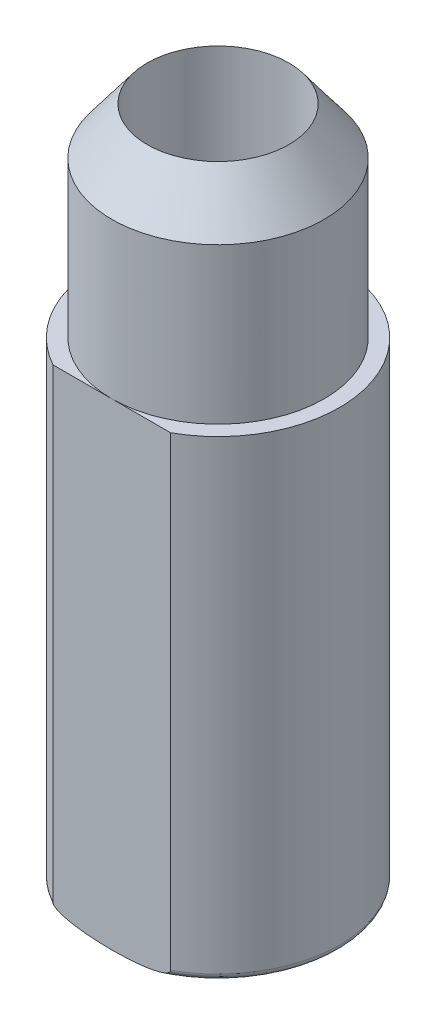
ISO-10303-21;
HEADER;
FILE_DESCRIPTION(('STEP AP214'),'2;1');
FILE_NAME('part.step','',(''),(''),'','','');
FILE_SCHEMA(('AUTOMOTIVE_DESIGN { 1 0 10303 214 1 1 1 1 }'));
ENDSEC;
DATA;
#1=APPLICATION_CONTEXT('core data for automotive mechanical design processes');
#2=APPLICATION_PROTOCOL_DEFINITION('international standard','automotive_design',2000,#1);
#3=PRODUCT_CONTEXT('',#1,'mechanical');
#4=PRODUCT('Part','Part','',(#3));
#5=PRODUCT_RELATED_PRODUCT_CATEGORY('part','',(#4));
#6=PRODUCT_DEFINITION_FORMATION('','',#4);
#7=PRODUCT_DEFINITION_CONTEXT('part definition',#1,'design');
#8=PRODUCT_DEFINITION('design','',#6,#7);
#9=PRODUCT_DEFINITION_SHAPE('','',#8);
#10=(LENGTH_UNIT() NAMED_UNIT(*) SI_UNIT(.MILLI.,.METRE.));
#11=(NAMED_UNIT(*) PLANE_ANGLE_UNIT() SI_UNIT($,.RADIAN.));
#12=(NAMED_UNIT(*) SI_UNIT($,.STERADIAN.) SOLID_ANGLE_UNIT());
#13=UNCERTAINTY_MEASURE_WITH_UNIT(LENGTH_MEASURE(1.E-05),#10,'distance_accuracy_value','');
#14=(GEOMETRIC_REPRESENTATION_CONTEXT(3) GLOBAL_UNCERTAINTY_ASSIGNED_CONTEXT((#13)) GLOBAL_UNIT_ASSIGNED_CONTEXT((#10,
#11,#12)) REPRESENTATION_CONTEXT('',''));
#15=CARTESIAN_POINT('',(0.,0.,0.));
#16=DIRECTION('',(0.,0.,1.));
#17=DIRECTION('',(1.,0.,0.));
#18=AXIS2_PLACEMENT_3D('',#15,#16,#17);
#19=CARTESIAN_POINT('',(0.,76.2,0.));
#20=DIRECTION('',(0.,-1.,0.));
#21=DIRECTION('',(0.,0.,-1.));
#22=AXIS2_PLACEMENT_3D('',#19,#20,#21);
#23=CYLINDRICAL_SURFACE('',#22,19.05);
#24=CARTESIAN_POINT('',(0.,3.175,0.));
#25=DIRECTION('',(0.,-1.,0.));
#26=DIRECTION('',(0.,0.,-1.));
#27=AXIS2_PLACEMENT_3D('',#24,#25,#26);
#28=CIRCLE('',#27,19.05);
#29=CARTESIAN_POINT('',(-9.22254159315643,3.175,16.66875));
#30=VERTEX_POINT('',#29);
#31=CARTESIAN_POINT('',(9.22254159315642,3.17500000000003,16.66875));
#32=VERTEX_POINT('',#31);
#33=EDGE_CURVE('E59',#30,#32,#28,.T.);
#34=ORIENTED_EDGE('',*,*,#33,.F.);
#35=DIRECTION('',(0.,-1.,0.));
#36=VECTOR('',#35,1.);
#37=CARTESIAN_POINT('',(-9.22254159315642,76.2,16.66875));
#38=LINE('',#37,#36);
#39=CARTESIAN_POINT('',(-9.22254159315641,76.2,16.66875));
#40=VERTEX_POINT('',#39);
#41=EDGE_CURVE('E66',#30,#40,#38,.F.);
#42=ORIENTED_EDGE('',*,*,#41,.T.);
#43=CARTESIAN_POINT('',(0.,76.2,0.));
#44=DIRECTION('',(0.,1.,0.));
#45=DIRECTION('',(0.,0.,1.));
#46=AXIS2_PLACEMENT_3D('',#43,#44,#45);
#47=CIRCLE('',#46,19.05);
#48=CARTESIAN_POINT('',(9.22254159315641,76.2,16.66875));
#49=VERTEX_POINT('',#48);
#50=EDGE_CURVE('E91',#49,#40,#47,.T.);
#51=ORIENTED_EDGE('',*,*,#50,.F.);
#52=DIRECTION('',(0.,-1.,0.));
#53=VECTOR('',#52,1.);
#54=CARTESIAN_POINT('',(9.22254159315642,76.2,16.66875));
#55=LINE('',#54,#53);
#56=EDGE_CURVE('E54',#49,#32,#55,.T.);
#57=ORIENTED_EDGE('',*,*,#56,.T.);
#58=EDGE_LOOP('',(#34,#42,#51,#57));
#59=FACE_BOUND('',#58,.T.);
#60=ADVANCED_FACE('F40',(#59),#23,.T.);
#61=CARTESIAN_POINT('',(0.,76.2,0.));
#62=DIRECTION('',(0.,-1.,0.));
#63=DIRECTION('',(0.,0.,-1.));
#64=AXIS2_PLACEMENT_3D('',#61,#62,#63);
#65=CYLINDRICAL_SURFACE('',#64,11.1125);
#66=CARTESIAN_POINT('',(0.,107.95,0.));
#67=DIRECTION('',(0.,-1.,0.));
#68=DIRECTION('',(0.,0.,-1.));
#69=AXIS2_PLACEMENT_3D('',#66,#67,#68);
#70=CIRCLE('',#69,11.1125);
#71=CARTESIAN_POINT('',(0.,107.95,-11.1125));
#72=VERTEX_POINT('',#71);
#73=EDGE_CURVE('E95',#72,#72,#70,.T.);
#74=ORIENTED_EDGE('',*,*,#73,.F.);
#75=EDGE_LOOP('',(#74));
#76=FACE_BOUND('',#75,.T.);
#77=CARTESIAN_POINT('',(0.,0.231696225433908,0.));
#78=DIRECTION('',(0.,-1.,0.));
#79=DIRECTION('',(0.,0.,-1.));
#80=AXIS2_PLACEMENT_3D('',#77,#78,#79);
#81=CIRCLE('',#80,11.1125);
#82=CARTESIAN_POINT('',(0.,0.231696225433908,-11.1125));
#83=VERTEX_POINT('',#82);
#84=EDGE_CURVE('E79',#83,#83,#81,.T.);
#85=ORIENTED_EDGE('',*,*,#84,.T.);
#86=EDGE_LOOP('',(#85));
#87=FACE_BOUND('',#86,.T.);
#88=ADVANCED_FACE('F119',(#76,#87),#65,.F.);
#89=CARTESIAN_POINT('',(24.2711047016303,0.,16.66875));
#90=DIRECTION('',(0.,0.,-1.));
#91=DIRECTION('',(-1.,0.,0.));
#92=AXIS2_PLACEMENT_3D('',#89,#90,#91);
#93=PLANE('',#92);
#94=CARTESIAN_POINT('',(9.22254159315641,3.175,16.66875));
#95=CARTESIAN_POINT('',(9.22254606778377,3.1629881546595,16.66875));
#96=CARTESIAN_POINT('',(9.22197797228461,3.15098338715665,16.66875));
#97=CARTESIAN_POINT('',(9.21973942484359,3.12709306561417,16.66875));
#98=CARTESIAN_POINT('',(9.21807047519535,3.11520737148848,16.66875));
#99=CARTESIAN_POINT('',(9.21153464750275,3.0801623785676,16.66875));
#100=CARTESIAN_POINT('',(9.2051361985547,3.0572792106606,16.66875));
#101=CARTESIAN_POINT('',(9.18647176949325,3.0061747306503,16.66875));
#102=CARTESIAN_POINT('',(9.17302515770907,2.97839604343599,16.66875));
#103=CARTESIAN_POINT('',(9.14189481847611,2.9251910866358,16.66875));
#104=CARTESIAN_POINT('',(9.1241859720157,2.89978005053384,16.66875));
#105=CARTESIAN_POINT('',(9.08792028837702,2.85390658989999,16.66875));
#106=CARTESIAN_POINT('',(9.06965820119863,2.83320573026087,16.66875));
#107=CARTESIAN_POINT('',(9.03142675859457,2.79342979725043,16.66875));
#108=CARTESIAN_POINT('',(9.01145593188844,2.7743561537631,16.66875));
#109=CARTESIAN_POINT('',(8.97022847075626,2.73760447559731,16.66875));
#110=CARTESIAN_POINT('',(8.94896999008213,2.71992853281137,16.66875));
#111=CARTESIAN_POINT('',(8.90550381857863,2.6858128314063,16.66875));
#112=CARTESIAN_POINT('',(8.88329648616773,2.66937261236882,16.66875));
#113=CARTESIAN_POINT('',(8.82479887374419,2.62814796686749,16.66875));
#114=CARTESIAN_POINT('',(8.78793962330154,2.60417204786244,16.66875));
#115=CARTESIAN_POINT('',(8.71290051102256,2.55837079888831,16.66875));
#116=CARTESIAN_POINT('',(8.67471991659821,2.53654668860634,16.66875));
#117=CARTESIAN_POINT('',(8.55861874648863,2.4736408524192,16.66875));
#118=CARTESIAN_POINT('',(8.47926479795816,2.43520950713879,16.66875));
#119=CARTESIAN_POINT('',(8.31793083478968,2.36319293073343,16.66875));
#120=CARTESIAN_POINT('',(8.23593877782103,2.32963551405348,16.66875));
#121=CARTESIAN_POINT('',(8.07058619801096,2.2664385688428,16.66875));
#122=CARTESIAN_POINT('',(7.98722748718518,2.23679426046164,16.66875));
#123=CARTESIAN_POINT('',(7.78219657233457,2.16805866969926,16.66875));
#124=CARTESIAN_POINT('',(7.65997135467144,2.1306287846481,16.66875));
#125=CARTESIAN_POINT('',(7.41413367160966,2.06059018805917,16.66875));
#126=CARTESIAN_POINT('',(7.29052082117956,2.02798285210247,16.66875));
#127=CARTESIAN_POINT('',(7.04208913157886,1.96656641431697,16.66875));
#128=CARTESIAN_POINT('',(6.91726831918551,1.937765351413,16.66875));
#129=CARTESIAN_POINT('',(6.66692579773154,1.88337285213374,16.66875));
#130=CARTESIAN_POINT('',(6.54140403407761,1.85778166950575,16.66875));
#131=CARTESIAN_POINT('',(6.16382174664767,1.78503042718831,16.66875));
#132=CARTESIAN_POINT('',(5.91097423054029,1.74194736510495,16.66875));
#133=CARTESIAN_POINT('',(5.4040500921396,1.66411888734336,16.66875));
#134=CARTESIAN_POINT('',(5.14997354228582,1.62937298623497,16.66875));
#135=CARTESIAN_POINT('',(4.64133702267686,1.56675752661278,16.66875));
#136=CARTESIAN_POINT('',(4.38677820260846,1.5388785523361,16.66875));
#137=CARTESIAN_POINT('',(3.87718180834107,1.48895052687898,16.66875));
#138=CARTESIAN_POINT('',(3.62214441763624,1.46689957480072,16.6687499999999));
#139=CARTESIAN_POINT('',(3.02357033550386,1.42121074715611,16.6687499999998));
#140=CARTESIAN_POINT('',(2.67987475124389,1.39965272953413,16.6687499999999));
#141=CARTESIAN_POINT('',(1.99196797357422,1.36477058047847,16.66875));
#142=CARTESIAN_POINT('',(1.64775665214386,1.35144903678658,16.66875));
#143=CARTESIAN_POINT('',(0.959733168110416,1.33248411640517,16.66875));
#144=CARTESIAN_POINT('',(0.615921377634202,1.32682718868932,16.66875));
#145=CARTESIAN_POINT('',(-0.0717448674756204,1.32291717100372,16.66875));
#146=CARTESIAN_POINT('',(-0.415599322753855,1.32466421140059,16.66875));
#147=CARTESIAN_POINT('',(-1.22809700860532,1.33759894352558,16.66875));
#148=CARTESIAN_POINT('',(-1.69669734710899,1.35198546979525,16.66875));
#149=CARTESIAN_POINT('',(-2.39913170048791,1.38483199565114,16.66875));
#150=CARTESIAN_POINT('',(-2.63323956924977,1.39766184681142,16.66875));
#151=CARTESIAN_POINT('',(-3.1011960673583,1.42737655651722,16.66875));
#152=CARTESIAN_POINT('',(-3.33504470196266,1.44426133125248,16.66875));
#153=CARTESIAN_POINT('',(-3.88749216309281,1.48943049656623,16.66875));
#154=CARTESIAN_POINT('',(-4.20593759152963,1.51962698881809,16.66875));
#155=CARTESIAN_POINT('',(-4.84172642256794,1.5897692612377,16.66875));
#156=CARTESIAN_POINT('',(-5.15907000596443,1.62971335706962,16.6687499999998));
#157=CARTESIAN_POINT('',(-5.69213521131905,1.70736832897352,16.6687499999999));
#158=CARTESIAN_POINT('',(-5.90833202923688,1.74180818939681,16.66875));
#159=CARTESIAN_POINT('',(-6.33951105882302,1.81778149665756,16.66875));
#160=CARTESIAN_POINT('',(-6.55449323743743,1.85931513558616,16.66875));
#161=CARTESIAN_POINT('',(-6.9157343839279,1.93720999030806,16.66875));
#162=CARTESIAN_POINT('',(-7.06251487779857,1.97114420608181,16.66875));
#163=CARTESIAN_POINT('',(-7.35468643347198,2.04447772524628,16.66875));
#164=CARTESIAN_POINT('',(-7.50007788190048,2.08387545757643,16.66875));
#165=CARTESIAN_POINT('',(-7.74444495049113,2.15670268803965,16.66875));
#166=CARTESIAN_POINT('',(-7.8439762224163,2.18825506125298,16.66875));
#167=CARTESIAN_POINT('',(-8.04159305216791,2.25578946347049,16.66875));
#168=CARTESIAN_POINT('',(-8.13967789751803,2.29177359888232,16.66875));
#169=CARTESIAN_POINT('',(-8.32823541525081,2.36745914813959,16.66875));
#170=CARTESIAN_POINT('',(-8.41883023131569,2.40684769716333,16.6687499999999));
#171=CARTESIAN_POINT('',(-8.55206327217623,2.47141235655806,16.66875));
#172=CARTESIAN_POINT('',(-8.59602727302763,2.49384529618027,16.6687500000001));
#173=CARTESIAN_POINT('',(-8.68272869927184,2.5409549514331,16.6687499999999));
#174=CARTESIAN_POINT('',(-8.72546657701292,2.56563082521089,16.6687499999995));
#175=CARTESIAN_POINT('',(-8.81399606930384,2.62075225944511,16.6687499999994));
#176=CARTESIAN_POINT('',(-8.85958027149799,2.65153487902817,16.6687499999999));
#177=CARTESIAN_POINT('',(-8.94738225939212,2.71767619293549,16.6687500000001));
#178=CARTESIAN_POINT('',(-8.98960265320783,2.75303128509789,16.66875));
#179=CARTESIAN_POINT('',(-9.05419775782409,2.81624819659929,16.6687499999999));
#180=CARTESIAN_POINT('',(-9.07830145027011,2.84232248703585,16.66875));
#181=CARTESIAN_POINT('',(-9.12277686704237,2.89752263231704,16.66875));
#182=CARTESIAN_POINT('',(-9.14315459503167,2.92664345705885,16.66875));
#183=CARTESIAN_POINT('',(-9.17301918528461,2.97899370386308,16.66875));
#184=CARTESIAN_POINT('',(-9.18394209718991,3.00139450820551,16.66875));
#185=CARTESIAN_POINT('',(-9.20209719642695,3.0476178177468,16.66875));
#186=CARTESIAN_POINT('',(-9.20934135904295,3.07143542430876,16.66875));
#187=CARTESIAN_POINT('',(-9.21704525679595,3.10871854805596,16.66875));
#188=CARTESIAN_POINT('',(-9.21909329172745,3.12186590616567,16.66875));
#189=CARTESIAN_POINT('',(-9.22184690919064,3.14833840575267,16.66875));
#190=CARTESIAN_POINT('',(-9.2225485576283,3.1616639540094,16.66875));
#191=CARTESIAN_POINT('',(-9.22254159315641,3.175,16.66875));
#192=B_SPLINE_CURVE_WITH_KNOTS('',3,(#94,#95,#96,#97,#98,#99,#100,#101,#102,#103,#104,#105,#106,
#107,#108,#109,#110,#111,#112,#113,#114,#115,#116,#117,#118,#119,#120,#121,#122,#123,#124,#125,
#126,#127,#128,#129,#130,#131,#132,#133,#134,#135,#136,#137,#138,#139,#140,#141,#142,#143,#144,
#145,#146,#147,#148,#149,#150,#151,#152,#153,#154,#155,#156,#157,#158,#159,#160,#161,#162,#163,
#164,#165,#166,#167,#168,#169,#170,#171,#172,#173,#174,#175,#176,#177,#178,#179,#180,#181,#182,
#183,#184,#185,#186,#187,#188,#189,#190,#191),.UNSPECIFIED.,.F.,.F.,(4,2,2,2,2,2,2,2,2,2,2,2,2,
2,2,2,2,2,2,2,2,2,2,2,2,2,2,2,2,2,2,2,2,2,2,2,2,2,2,2,2,2,2,2,2,2,2,2,4),(0.,0.0360092951232805,
0.0719695511225502,0.142897335979975,0.234972491496345,0.327604173848465,0.41029899762355,
0.493065755020224,0.575954130022981,0.658811466958355,0.790620132487981,0.922503085339752,
1.18672118529809,1.45239239799874,1.71773603038405,2.10107899336235,2.48453109084612,
2.86878052748982,3.25306032068498,4.022328489893,4.79155185768361,5.55971453898097,
6.3276263623073,7.36062165382101,8.39394132789881,9.42543170038312,10.4569402350837,
11.8631494090528,12.5664993008945,13.26983465661,14.2293358556368,15.1886713750367,
15.8453552815703,16.502056973149,16.9539391225309,17.4056915994253,17.7188509135646,
18.0321596503175,18.3282542697732,18.4762750879469,18.6242405762729,18.7890767151517,
18.9537837793903,19.0600945904138,19.1662325630435,19.2407579980297,19.3150392527431,
19.3548939173985,19.3948648597054),.UNSPECIFIED.);
#193=EDGE_CURVE('E11',#32,#30,#192,.T.);
#194=ORIENTED_EDGE('',*,*,#193,.F.);
#195=ORIENTED_EDGE('',*,*,#56,.F.);
#196=DIRECTION('',(-1.,0.,0.));
#197=VECTOR('',#196,1.);
#198=CARTESIAN_POINT('',(24.2711047016303,76.2,16.66875));
#199=LINE('',#198,#197);
#200=CARTESIAN_POINT('',(0.,76.2,16.66875));
#201=VERTEX_POINT('',#200);
#202=EDGE_CURVE('E104',#49,#201,#199,.T.);
#203=ORIENTED_EDGE('',*,*,#202,.T.);
#204=EDGE_CURVE('E83',#201,#40,#199,.T.);
#205=ORIENTED_EDGE('',*,*,#204,.T.);
#206=ORIENTED_EDGE('',*,*,#41,.F.);
#207=EDGE_LOOP('',(#194,#195,#203,#205,#206));
#208=FACE_BOUND('',#207,.T.);
#209=ADVANCED_FACE('F81',(#208),#93,.F.);
#210=CARTESIAN_POINT('',(0.,76.2,0.));
#211=DIRECTION('',(0.,1.,0.));
#212=DIRECTION('',(0.,0.,1.));
#213=AXIS2_PLACEMENT_3D('',#210,#211,#212);
#214=PLANE('',#213);
#215=ORIENTED_EDGE('',*,*,#202,.F.);
#216=ORIENTED_EDGE('',*,*,#50,.T.);
#217=ORIENTED_EDGE('',*,*,#204,.F.);
#218=CARTESIAN_POINT('',(0.,76.2,0.));
#219=DIRECTION('',(0.,1.,0.));
#220=DIRECTION('',(0.,0.,1.));
#221=AXIS2_PLACEMENT_3D('',#218,#219,#220);
#222=CIRCLE('',#221,16.66875);
#223=EDGE_CURVE('E86',#201,#201,#222,.T.);
#224=ORIENTED_EDGE('',*,*,#223,.F.);
#225=EDGE_LOOP('',(#215,#216,#217,#224));
#226=FACE_BOUND('',#225,.T.);
#227=ADVANCED_FACE('F118',(#226),#214,.T.);
#228=CARTESIAN_POINT('',(0.,107.95,0.));
#229=DIRECTION('',(0.,-1.,0.));
#230=DIRECTION('',(0.,0.,-1.));
#231=AXIS2_PLACEMENT_3D('',#228,#229,#230);
#232=CYLINDRICAL_SURFACE('',#231,16.66875);
#233=CARTESIAN_POINT('',(0.,100.576607209871,0.));
#234=DIRECTION('',(0.,-1.,0.));
#235=DIRECTION('',(0.,0.,-1.));
#236=AXIS2_PLACEMENT_3D('',#233,#234,#235);
#237=CIRCLE('',#236,16.66875);
#238=CARTESIAN_POINT('',(0.,100.576607209871,-16.66875));
#239=VERTEX_POINT('',#238);
#240=EDGE_CURVE('E100',#239,#239,#237,.T.);
#241=ORIENTED_EDGE('',*,*,#240,.T.);
#242=EDGE_LOOP('',(#241));
#243=FACE_BOUND('',#242,.T.);
#244=ORIENTED_EDGE('',*,*,#223,.T.);
#245=EDGE_LOOP('',(#244));
#246=FACE_BOUND('',#245,.T.);
#247=ADVANCED_FACE('F122',(#243,#246),#232,.T.);
#248=CARTESIAN_POINT('',(0.,107.95,0.));
#249=DIRECTION('',(0.,-1.,0.));
#250=DIRECTION('',(0.,0.,-1.));
#251=AXIS2_PLACEMENT_3D('',#248,#249,#250);
#252=CONICAL_SURFACE('',#251,11.1125,0.645771823237897);
#253=ORIENTED_EDGE('',*,*,#240,.F.);
#254=EDGE_LOOP('',(#253));
#255=FACE_BOUND('',#254,.T.);
#256=ORIENTED_EDGE('',*,*,#73,.T.);
#257=EDGE_LOOP('',(#256));
#258=FACE_BOUND('',#257,.T.);
#259=ADVANCED_FACE('F113',(#255,#258),#252,.T.);
#260=CARTESIAN_POINT('',(-6.34999999999998,3.175,0.));
#261=DIRECTION('',(0.,0.,-1.));
#262=DIRECTION('',(1.,0.,0.));
#263=AXIS2_PLACEMENT_3D('',#260,#261,#262);
#264=ELLIPSE('',#263,12.7,3.175);
#265=TRIMMED_CURVE('',#264,(PARAMETER_VALUE(1.0471975511966)),
(PARAMETER_VALUE(5.23598775598299)),.T.,.PARAMETER.);
#266=CARTESIAN_POINT('',(0.,0.,0.));
#267=DIRECTION('',(0.,-1.,0.));
#268=AXIS1_PLACEMENT('',#266,#267);
#269=SURFACE_OF_REVOLUTION('',#265,#268);
#270=ORIENTED_EDGE('',*,*,#84,.F.);
#271=EDGE_LOOP('',(#270));
#272=FACE_BOUND('',#271,.T.);
#273=ORIENTED_EDGE('',*,*,#193,.T.);
#274=ORIENTED_EDGE('',*,*,#33,.T.);
#275=EDGE_LOOP('',(#273,#274));
#276=FACE_BOUND('',#275,.T.);
#277=ADVANCED_FACE('F75',(#272,#276),#269,.F.);
#278=CLOSED_SHELL('',(#60,#88,#209,#227,#247,#259,#277));
#279=MANIFOLD_SOLID_BREP('B2',#278);
#280=ADVANCED_BREP_SHAPE_REPRESENTATION('',(#18,#279),#14);
#281=SHAPE_DEFINITION_REPRESENTATION(#9,#280);
ENDSEC;
END-ISO-10303-21;
